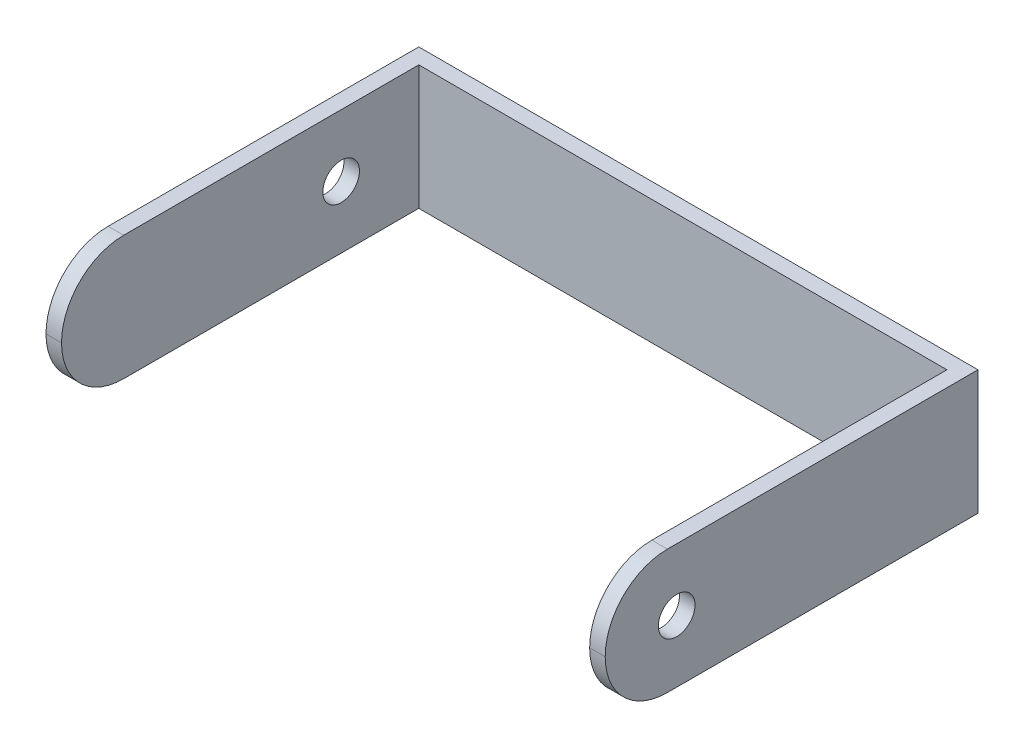
ISO-10303-21;
HEADER;
FILE_DESCRIPTION(('STEP AP214'),'2;1');
FILE_NAME('part.step','',(''),(''),'','','');
FILE_SCHEMA(('AUTOMOTIVE_DESIGN { 1 0 10303 214 1 1 1 1 }'));
ENDSEC;
DATA;
#1=APPLICATION_CONTEXT('core data for automotive mechanical design processes');
#2=APPLICATION_PROTOCOL_DEFINITION('international standard','automotive_design',2000,#1);
#3=PRODUCT_CONTEXT('',#1,'mechanical');
#4=PRODUCT('Part','Part','',(#3));
#5=PRODUCT_RELATED_PRODUCT_CATEGORY('part','',(#4));
#6=PRODUCT_DEFINITION_FORMATION('','',#4);
#7=PRODUCT_DEFINITION_CONTEXT('part definition',#1,'design');
#8=PRODUCT_DEFINITION('design','',#6,#7);
#9=PRODUCT_DEFINITION_SHAPE('','',#8);
#10=(LENGTH_UNIT() NAMED_UNIT(*) SI_UNIT(.MILLI.,.METRE.));
#11=(NAMED_UNIT(*) PLANE_ANGLE_UNIT() SI_UNIT($,.RADIAN.));
#12=(NAMED_UNIT(*) SI_UNIT($,.STERADIAN.) SOLID_ANGLE_UNIT());
#13=UNCERTAINTY_MEASURE_WITH_UNIT(LENGTH_MEASURE(1.E-05),#10,'distance_accuracy_value','');
#14=(GEOMETRIC_REPRESENTATION_CONTEXT(3) GLOBAL_UNCERTAINTY_ASSIGNED_CONTEXT((#13)) GLOBAL_UNIT_ASSIGNED_CONTEXT((#10,
#11,#12)) REPRESENTATION_CONTEXT('',''));
#15=CARTESIAN_POINT('',(0.,0.,0.));
#16=DIRECTION('',(0.,0.,1.));
#17=DIRECTION('',(1.,0.,0.));
#18=AXIS2_PLACEMENT_3D('',#15,#16,#17);
#19=CARTESIAN_POINT('',(0.,0.,12.7));
#20=DIRECTION('',(0.,0.,1.));
#21=DIRECTION('',(1.,0.,0.));
#22=AXIS2_PLACEMENT_3D('',#19,#20,#21);
#23=PLANE('',#22);
#24=DIRECTION('',(0.,-1.,0.));
#25=VECTOR('',#24,1.);
#26=CARTESIAN_POINT('',(444.5,101.6,12.7));
#27=LINE('',#26,#25);
#28=CARTESIAN_POINT('',(444.5,101.6,12.7));
#29=VERTEX_POINT('',#28);
#30=CARTESIAN_POINT('',(444.5,0.,12.7));
#31=VERTEX_POINT('',#30);
#32=EDGE_CURVE('E118',#29,#31,#27,.T.);
#33=ORIENTED_EDGE('',*,*,#32,.F.);
#34=DIRECTION('',(-1.,0.,0.));
#35=VECTOR('',#34,1.);
#36=CARTESIAN_POINT('',(457.2,101.6,12.7));
#37=LINE('',#36,#35);
#38=CARTESIAN_POINT('',(12.7,101.6,12.7));
#39=VERTEX_POINT('',#38);
#40=EDGE_CURVE('E126',#29,#39,#37,.T.);
#41=ORIENTED_EDGE('',*,*,#40,.T.);
#42=DIRECTION('',(0.,-1.,0.));
#43=VECTOR('',#42,1.);
#44=CARTESIAN_POINT('',(12.7,101.6,12.7));
#45=LINE('',#44,#43);
#46=CARTESIAN_POINT('',(12.7,0.,12.7));
#47=VERTEX_POINT('',#46);
#48=EDGE_CURVE('E143',#39,#47,#45,.T.);
#49=ORIENTED_EDGE('',*,*,#48,.T.);
#50=DIRECTION('',(1.,0.,0.));
#51=VECTOR('',#50,1.);
#52=CARTESIAN_POINT('',(0.,0.,12.7));
#53=LINE('',#52,#51);
#54=EDGE_CURVE('E134',#47,#31,#53,.T.);
#55=ORIENTED_EDGE('',*,*,#54,.T.);
#56=EDGE_LOOP('',(#33,#41,#49,#55));
#57=FACE_BOUND('',#56,.T.);
#58=ADVANCED_FACE('F39',(#57),#23,.T.);
#59=CARTESIAN_POINT('',(0.,101.6,12.7));
#60=DIRECTION('',(1.,0.,0.));
#61=DIRECTION('',(0.,1.,0.));
#62=AXIS2_PLACEMENT_3D('',#59,#60,#61);
#63=PLANE('',#62);
#64=CARTESIAN_POINT('',(0.,50.8,76.2));
#65=DIRECTION('',(-1.,0.,0.));
#66=DIRECTION('',(0.,-1.,0.));
#67=AXIS2_PLACEMENT_3D('',#64,#65,#66);
#68=CIRCLE('',#67,14.985);
#69=CARTESIAN_POINT('',(0.,35.815,76.2));
#70=VERTEX_POINT('',#69);
#71=EDGE_CURVE('E382',#70,#70,#68,.T.);
#72=ORIENTED_EDGE('',*,*,#71,.F.);
#73=EDGE_LOOP('',(#72));
#74=FACE_BOUND('',#73,.T.);
#75=DIRECTION('',(0.,0.,-1.));
#76=VECTOR('',#75,1.);
#77=CARTESIAN_POINT('',(0.,0.,12.7));
#78=LINE('',#77,#76);
#79=CARTESIAN_POINT('',(0.,0.,254.));
#80=VERTEX_POINT('',#79);
#81=CARTESIAN_POINT('',(0.,0.,0.));
#82=VERTEX_POINT('',#81);
#83=EDGE_CURVE('E164',#80,#82,#78,.T.);
#84=ORIENTED_EDGE('',*,*,#83,.F.);
#85=CARTESIAN_POINT('',(0.,50.8,254.));
#86=DIRECTION('',(1.,0.,0.));
#87=DIRECTION('',(0.,1.,0.));
#88=AXIS2_PLACEMENT_3D('',#85,#86,#87);
#89=CIRCLE('',#88,50.8);
#90=CARTESIAN_POINT('',(0.,50.8,304.8));
#91=VERTEX_POINT('',#90);
#92=EDGE_CURVE('E48',#80,#91,#89,.F.);
#93=ORIENTED_EDGE('',*,*,#92,.T.);
#94=CARTESIAN_POINT('',(0.,50.8,254.));
#95=DIRECTION('',(1.,0.,0.));
#96=DIRECTION('',(0.,1.,0.));
#97=AXIS2_PLACEMENT_3D('',#94,#95,#96);
#98=CIRCLE('',#97,50.8);
#99=CARTESIAN_POINT('',(0.,101.6,254.));
#100=VERTEX_POINT('',#99);
#101=EDGE_CURVE('E55',#91,#100,#98,.F.);
#102=ORIENTED_EDGE('',*,*,#101,.T.);
#103=DIRECTION('',(0.,0.,-1.));
#104=VECTOR('',#103,1.);
#105=CARTESIAN_POINT('',(0.,101.6,12.7));
#106=LINE('',#105,#104);
#107=CARTESIAN_POINT('',(0.,101.6,0.));
#108=VERTEX_POINT('',#107);
#109=EDGE_CURVE('E133',#100,#108,#106,.T.);
#110=ORIENTED_EDGE('',*,*,#109,.T.);
#111=DIRECTION('',(0.,-1.,0.));
#112=VECTOR('',#111,1.);
#113=CARTESIAN_POINT('',(0.,101.6,0.));
#114=LINE('',#113,#112);
#115=EDGE_CURVE('E146',#108,#82,#114,.T.);
#116=ORIENTED_EDGE('',*,*,#115,.T.);
#117=EDGE_LOOP('',(#84,#93,#102,#110,#116));
#118=FACE_BOUND('',#117,.T.);
#119=ADVANCED_FACE('F197',(#74,#118),#63,.F.);
#120=CARTESIAN_POINT('',(0.,0.,12.7));
#121=DIRECTION('',(0.,1.,0.));
#122=DIRECTION('',(0.,0.,1.));
#123=AXIS2_PLACEMENT_3D('',#120,#121,#122);
#124=PLANE('',#123);
#125=DIRECTION('',(0.,0.,-1.));
#126=VECTOR('',#125,1.);
#127=CARTESIAN_POINT('',(12.7,0.,0.));
#128=LINE('',#127,#126);
#129=CARTESIAN_POINT('',(12.7,0.,254.));
#130=VERTEX_POINT('',#129);
#131=EDGE_CURVE('E138',#130,#47,#128,.T.);
#132=ORIENTED_EDGE('',*,*,#131,.F.);
#133=DIRECTION('',(1.,0.,0.));
#134=VECTOR('',#133,1.);
#135=CARTESIAN_POINT('',(0.,0.,254.));
#136=LINE('',#135,#134);
#137=EDGE_CURVE('E186',#130,#80,#136,.F.);
#138=ORIENTED_EDGE('',*,*,#137,.T.);
#139=ORIENTED_EDGE('',*,*,#83,.T.);
#140=DIRECTION('',(1.,0.,0.));
#141=VECTOR('',#140,1.);
#142=CARTESIAN_POINT('',(0.,0.,0.));
#143=LINE('',#142,#141);
#144=CARTESIAN_POINT('',(457.2,0.,0.));
#145=VERTEX_POINT('',#144);
#146=EDGE_CURVE('E151',#82,#145,#143,.T.);
#147=ORIENTED_EDGE('',*,*,#146,.T.);
#148=DIRECTION('',(0.,0.,-1.));
#149=VECTOR('',#148,1.);
#150=CARTESIAN_POINT('',(457.2,0.,12.7));
#151=LINE('',#150,#149);
#152=CARTESIAN_POINT('',(457.2,0.,254.));
#153=VERTEX_POINT('',#152);
#154=EDGE_CURVE('E162',#153,#145,#151,.T.);
#155=ORIENTED_EDGE('',*,*,#154,.F.);
#156=DIRECTION('',(-1.,0.,0.));
#157=VECTOR('',#156,1.);
#158=CARTESIAN_POINT('',(444.5,0.,254.));
#159=LINE('',#158,#157);
#160=CARTESIAN_POINT('',(444.5,0.,254.));
#161=VERTEX_POINT('',#160);
#162=EDGE_CURVE('E166',#153,#161,#159,.T.);
#163=ORIENTED_EDGE('',*,*,#162,.T.);
#164=DIRECTION('',(0.,0.,-1.));
#165=VECTOR('',#164,1.);
#166=CARTESIAN_POINT('',(444.5,0.,304.8));
#167=LINE('',#166,#165);
#168=EDGE_CURVE('E123',#161,#31,#167,.T.);
#169=ORIENTED_EDGE('',*,*,#168,.T.);
#170=ORIENTED_EDGE('',*,*,#54,.F.);
#171=EDGE_LOOP('',(#132,#138,#139,#147,#155,#163,#169,#170));
#172=FACE_BOUND('',#171,.T.);
#173=ADVANCED_FACE('F193',(#172),#124,.F.);
#174=CARTESIAN_POINT('',(457.2,0.,12.7));
#175=DIRECTION('',(-1.,0.,0.));
#176=DIRECTION('',(0.,0.,1.));
#177=AXIS2_PLACEMENT_3D('',#174,#175,#176);
#178=PLANE('',#177);
#179=CARTESIAN_POINT('',(457.2,50.8,246.361498901065));
#180=DIRECTION('',(1.,0.,0.));
#181=DIRECTION('',(0.,0.,-1.));
#182=AXIS2_PLACEMENT_3D('',#179,#180,#181);
#183=CIRCLE('',#182,14.985);
#184=CARTESIAN_POINT('',(457.2,50.8,231.376498901065));
#185=VERTEX_POINT('',#184);
#186=EDGE_CURVE('E182',#185,#185,#183,.T.);
#187=ORIENTED_EDGE('',*,*,#186,.F.);
#188=EDGE_LOOP('',(#187));
#189=FACE_BOUND('',#188,.T.);
#190=CARTESIAN_POINT('',(457.2,50.8000000000001,254.));
#191=DIRECTION('',(-1.,0.,0.));
#192=DIRECTION('',(0.,0.,1.));
#193=AXIS2_PLACEMENT_3D('',#190,#191,#192);
#194=CIRCLE('',#193,50.8);
#195=CARTESIAN_POINT('',(457.2,101.6,254.));
#196=VERTEX_POINT('',#195);
#197=CARTESIAN_POINT('',(457.2,50.8000000000001,304.8));
#198=VERTEX_POINT('',#197);
#199=EDGE_CURVE('E172',#196,#198,#194,.F.);
#200=ORIENTED_EDGE('',*,*,#199,.T.);
#201=CARTESIAN_POINT('',(457.2,50.8,254.));
#202=DIRECTION('',(-1.,0.,0.));
#203=DIRECTION('',(0.,0.,1.));
#204=AXIS2_PLACEMENT_3D('',#201,#202,#203);
#205=CIRCLE('',#204,50.8);
#206=EDGE_CURVE('E174',#198,#153,#205,.F.);
#207=ORIENTED_EDGE('',*,*,#206,.T.);
#208=ORIENTED_EDGE('',*,*,#154,.T.);
#209=DIRECTION('',(0.,1.,0.));
#210=VECTOR('',#209,1.);
#211=CARTESIAN_POINT('',(457.2,0.,0.));
#212=LINE('',#211,#210);
#213=CARTESIAN_POINT('',(457.2,101.6,0.));
#214=VERTEX_POINT('',#213);
#215=EDGE_CURVE('E154',#145,#214,#212,.T.);
#216=ORIENTED_EDGE('',*,*,#215,.T.);
#217=DIRECTION('',(0.,0.,-1.));
#218=VECTOR('',#217,1.);
#219=CARTESIAN_POINT('',(457.2,101.6,12.7));
#220=LINE('',#219,#218);
#221=EDGE_CURVE('E160',#196,#214,#220,.T.);
#222=ORIENTED_EDGE('',*,*,#221,.F.);
#223=EDGE_LOOP('',(#200,#207,#208,#216,#222));
#224=FACE_BOUND('',#223,.T.);
#225=ADVANCED_FACE('F214',(#189,#224),#178,.F.);
#226=CARTESIAN_POINT('',(457.2,101.6,12.7));
#227=DIRECTION('',(0.,-1.,0.));
#228=DIRECTION('',(1.,0.,0.));
#229=AXIS2_PLACEMENT_3D('',#226,#227,#228);
#230=PLANE('',#229);
#231=ORIENTED_EDGE('',*,*,#109,.F.);
#232=DIRECTION('',(1.,0.,0.));
#233=VECTOR('',#232,1.);
#234=CARTESIAN_POINT('',(457.2,101.6,254.));
#235=LINE('',#234,#233);
#236=CARTESIAN_POINT('',(12.7,101.6,254.));
#237=VERTEX_POINT('',#236);
#238=EDGE_CURVE('E11',#100,#237,#235,.T.);
#239=ORIENTED_EDGE('',*,*,#238,.T.);
#240=DIRECTION('',(0.,0.,-1.));
#241=VECTOR('',#240,1.);
#242=CARTESIAN_POINT('',(12.7,101.6,0.));
#243=LINE('',#242,#241);
#244=EDGE_CURVE('E129',#237,#39,#243,.T.);
#245=ORIENTED_EDGE('',*,*,#244,.T.);
#246=ORIENTED_EDGE('',*,*,#40,.F.);
#247=DIRECTION('',(0.,0.,-1.));
#248=VECTOR('',#247,1.);
#249=CARTESIAN_POINT('',(444.5,101.6,304.8));
#250=LINE('',#249,#248);
#251=CARTESIAN_POINT('',(444.5,101.6,254.));
#252=VERTEX_POINT('',#251);
#253=EDGE_CURVE('E113',#252,#29,#250,.T.);
#254=ORIENTED_EDGE('',*,*,#253,.F.);
#255=DIRECTION('',(-1.,0.,0.));
#256=VECTOR('',#255,1.);
#257=CARTESIAN_POINT('',(457.2,101.6,254.));
#258=LINE('',#257,#256);
#259=EDGE_CURVE('E176',#252,#196,#258,.F.);
#260=ORIENTED_EDGE('',*,*,#259,.T.);
#261=ORIENTED_EDGE('',*,*,#221,.T.);
#262=DIRECTION('',(-1.,0.,0.));
#263=VECTOR('',#262,1.);
#264=CARTESIAN_POINT('',(457.2,101.6,0.));
#265=LINE('',#264,#263);
#266=EDGE_CURVE('E147',#214,#108,#265,.T.);
#267=ORIENTED_EDGE('',*,*,#266,.T.);
#268=EDGE_LOOP('',(#231,#239,#245,#246,#254,#260,#261,#267));
#269=FACE_BOUND('',#268,.T.);
#270=ADVANCED_FACE('F127',(#269),#230,.F.);
#271=CARTESIAN_POINT('',(0.,0.,0.));
#272=DIRECTION('',(0.,0.,1.));
#273=DIRECTION('',(1.,0.,0.));
#274=AXIS2_PLACEMENT_3D('',#271,#272,#273);
#275=PLANE('',#274);
#276=ORIENTED_EDGE('',*,*,#115,.F.);
#277=ORIENTED_EDGE('',*,*,#266,.F.);
#278=ORIENTED_EDGE('',*,*,#215,.F.);
#279=ORIENTED_EDGE('',*,*,#146,.F.);
#280=EDGE_LOOP('',(#276,#277,#278,#279));
#281=FACE_BOUND('',#280,.T.);
#282=ADVANCED_FACE('F201',(#281),#275,.F.);
#283=CARTESIAN_POINT('',(12.7,101.6,0.));
#284=DIRECTION('',(-1.,0.,0.));
#285=DIRECTION('',(0.,0.,1.));
#286=AXIS2_PLACEMENT_3D('',#283,#284,#285);
#287=PLANE('',#286);
#288=CARTESIAN_POINT('',(12.7,50.8,76.2));
#289=DIRECTION('',(-1.,0.,0.));
#290=DIRECTION('',(0.,0.,1.));
#291=AXIS2_PLACEMENT_3D('',#288,#289,#290);
#292=CIRCLE('',#291,14.985);
#293=CARTESIAN_POINT('',(12.7,50.8,91.185));
#294=VERTEX_POINT('',#293);
#295=EDGE_CURVE('E249',#294,#294,#292,.F.);
#296=ORIENTED_EDGE('',*,*,#295,.F.);
#297=EDGE_LOOP('',(#296));
#298=FACE_BOUND('',#297,.T.);
#299=CARTESIAN_POINT('',(12.7,50.8,254.));
#300=DIRECTION('',(-1.,0.,0.));
#301=DIRECTION('',(0.,0.,1.));
#302=AXIS2_PLACEMENT_3D('',#299,#300,#301);
#303=CIRCLE('',#302,50.8);
#304=CARTESIAN_POINT('',(12.7,50.8,304.8));
#305=VERTEX_POINT('',#304);
#306=EDGE_CURVE('E178',#237,#305,#303,.F.);
#307=ORIENTED_EDGE('',*,*,#306,.T.);
#308=CARTESIAN_POINT('',(12.7,50.8,254.));
#309=DIRECTION('',(-1.,0.,0.));
#310=DIRECTION('',(0.,0.,1.));
#311=AXIS2_PLACEMENT_3D('',#308,#309,#310);
#312=CIRCLE('',#311,50.8);
#313=EDGE_CURVE('E184',#305,#130,#312,.F.);
#314=ORIENTED_EDGE('',*,*,#313,.T.);
#315=ORIENTED_EDGE('',*,*,#131,.T.);
#316=ORIENTED_EDGE('',*,*,#48,.F.);
#317=ORIENTED_EDGE('',*,*,#244,.F.);
#318=EDGE_LOOP('',(#307,#314,#315,#316,#317));
#319=FACE_BOUND('',#318,.T.);
#320=ADVANCED_FACE('F234',(#298,#319),#287,.F.);
#321=CARTESIAN_POINT('',(444.5,101.6,304.8));
#322=DIRECTION('',(-1.,0.,0.));
#323=DIRECTION('',(0.,0.,1.));
#324=AXIS2_PLACEMENT_3D('',#321,#322,#323);
#325=PLANE('',#324);
#326=CARTESIAN_POINT('',(444.5,50.8,246.361498901065));
#327=DIRECTION('',(-1.,0.,0.));
#328=DIRECTION('',(0.,0.,1.));
#329=AXIS2_PLACEMENT_3D('',#326,#327,#328);
#330=CIRCLE('',#329,14.985);
#331=CARTESIAN_POINT('',(444.5,50.8,261.346498901065));
#332=VERTEX_POINT('',#331);
#333=EDGE_CURVE('E376',#332,#332,#330,.F.);
#334=ORIENTED_EDGE('',*,*,#333,.T.);
#335=EDGE_LOOP('',(#334));
#336=FACE_BOUND('',#335,.T.);
#337=ORIENTED_EDGE('',*,*,#168,.F.);
#338=CARTESIAN_POINT('',(444.5,50.8,254.));
#339=DIRECTION('',(-1.,0.,0.));
#340=DIRECTION('',(0.,0.,1.));
#341=AXIS2_PLACEMENT_3D('',#338,#339,#340);
#342=CIRCLE('',#341,50.8);
#343=CARTESIAN_POINT('',(444.5,50.8000000000001,304.8));
#344=VERTEX_POINT('',#343);
#345=EDGE_CURVE('E170',#161,#344,#342,.T.);
#346=ORIENTED_EDGE('',*,*,#345,.T.);
#347=CARTESIAN_POINT('',(444.5,50.8000000000001,254.));
#348=DIRECTION('',(-1.,0.,0.));
#349=DIRECTION('',(0.,0.,1.));
#350=AXIS2_PLACEMENT_3D('',#347,#348,#349);
#351=CIRCLE('',#350,50.8);
#352=EDGE_CURVE('E120',#344,#252,#351,.T.);
#353=ORIENTED_EDGE('',*,*,#352,.T.);
#354=ORIENTED_EDGE('',*,*,#253,.T.);
#355=ORIENTED_EDGE('',*,*,#32,.T.);
#356=EDGE_LOOP('',(#337,#346,#353,#354,#355));
#357=FACE_BOUND('',#356,.T.);
#358=ADVANCED_FACE('F116',(#336,#357),#325,.T.);
#359=CARTESIAN_POINT('',(-0.000999999999973245,50.8,246.361498901065));
#360=DIRECTION('',(1.,0.,0.));
#361=DIRECTION('',(0.,0.,-1.));
#362=AXIS2_PLACEMENT_3D('',#359,#360,#361);
#363=CYLINDRICAL_SURFACE('',#362,14.985);
#364=ORIENTED_EDGE('',*,*,#333,.F.);
#365=EDGE_LOOP('',(#364));
#366=FACE_BOUND('',#365,.T.);
#367=ORIENTED_EDGE('',*,*,#186,.T.);
#368=EDGE_LOOP('',(#367));
#369=FACE_BOUND('',#368,.T.);
#370=ADVANCED_FACE('F244',(#366,#369),#363,.F.);
#371=CARTESIAN_POINT('',(457.2,50.8000000000001,254.));
#372=DIRECTION('',(1.,0.,0.));
#373=DIRECTION('',(0.,1.,0.));
#374=AXIS2_PLACEMENT_3D('',#371,#372,#373);
#375=CYLINDRICAL_SURFACE('',#374,50.8);
#376=DIRECTION('',(-1.,0.,0.));
#377=VECTOR('',#376,1.);
#378=CARTESIAN_POINT('',(444.5,50.8000000000001,304.8));
#379=LINE('',#378,#377);
#380=EDGE_CURVE('E179',#198,#344,#379,.T.);
#381=ORIENTED_EDGE('',*,*,#380,.F.);
#382=ORIENTED_EDGE('',*,*,#199,.F.);
#383=ORIENTED_EDGE('',*,*,#259,.F.);
#384=ORIENTED_EDGE('',*,*,#352,.F.);
#385=EDGE_LOOP('',(#381,#382,#383,#384));
#386=FACE_BOUND('',#385,.T.);
#387=ADVANCED_FACE('F211',(#386),#375,.T.);
#388=CARTESIAN_POINT('',(0.,50.8,254.));
#389=DIRECTION('',(1.,0.,0.));
#390=DIRECTION('',(0.,0.,-1.));
#391=AXIS2_PLACEMENT_3D('',#388,#389,#390);
#392=CYLINDRICAL_SURFACE('',#391,50.8);
#393=ORIENTED_EDGE('',*,*,#206,.F.);
#394=ORIENTED_EDGE('',*,*,#380,.T.);
#395=ORIENTED_EDGE('',*,*,#345,.F.);
#396=ORIENTED_EDGE('',*,*,#162,.F.);
#397=EDGE_LOOP('',(#393,#394,#395,#396));
#398=FACE_BOUND('',#397,.T.);
#399=ADVANCED_FACE('F208',(#398),#392,.T.);
#400=CARTESIAN_POINT('',(457.2,50.8000000000001,254.));
#401=DIRECTION('',(1.,0.,0.));
#402=DIRECTION('',(0.,1.,0.));
#403=AXIS2_PLACEMENT_3D('',#400,#401,#402);
#404=CYLINDRICAL_SURFACE('',#403,50.8);
#405=ORIENTED_EDGE('',*,*,#238,.F.);
#406=ORIENTED_EDGE('',*,*,#101,.F.);
#407=DIRECTION('',(1.,0.,0.));
#408=VECTOR('',#407,1.);
#409=CARTESIAN_POINT('',(0.,50.8,304.8));
#410=LINE('',#409,#408);
#411=EDGE_CURVE('E43',#305,#91,#410,.F.);
#412=ORIENTED_EDGE('',*,*,#411,.F.);
#413=ORIENTED_EDGE('',*,*,#306,.F.);
#414=EDGE_LOOP('',(#405,#406,#412,#413));
#415=FACE_BOUND('',#414,.T.);
#416=ADVANCED_FACE('F41',(#415),#404,.T.);
#417=CARTESIAN_POINT('',(0.,50.8,254.));
#418=DIRECTION('',(1.,0.,0.));
#419=DIRECTION('',(0.,0.,-1.));
#420=AXIS2_PLACEMENT_3D('',#417,#418,#419);
#421=CYLINDRICAL_SURFACE('',#420,50.8);
#422=ORIENTED_EDGE('',*,*,#92,.F.);
#423=ORIENTED_EDGE('',*,*,#137,.F.);
#424=ORIENTED_EDGE('',*,*,#313,.F.);
#425=ORIENTED_EDGE('',*,*,#411,.T.);
#426=EDGE_LOOP('',(#422,#423,#424,#425));
#427=FACE_BOUND('',#426,.T.);
#428=ADVANCED_FACE('F255',(#427),#421,.T.);
#429=CARTESIAN_POINT('',(457.201,50.8,76.2));
#430=DIRECTION('',(-1.,0.,0.));
#431=DIRECTION('',(0.,-1.,0.));
#432=AXIS2_PLACEMENT_3D('',#429,#430,#431);
#433=CYLINDRICAL_SURFACE('',#432,14.985);
#434=ORIENTED_EDGE('',*,*,#71,.T.);
#435=EDGE_LOOP('',(#434));
#436=FACE_BOUND('',#435,.T.);
#437=ORIENTED_EDGE('',*,*,#295,.T.);
#438=EDGE_LOOP('',(#437));
#439=FACE_BOUND('',#438,.T.);
#440=ADVANCED_FACE('F257',(#436,#439),#433,.F.);
#441=CLOSED_SHELL('',(#58,#119,#173,#225,#270,#282,#320,#358,#370,#387,#399,#416,#428,#440));
#442=MANIFOLD_SOLID_BREP('B2',#441);
#443=ADVANCED_BREP_SHAPE_REPRESENTATION('',(#18,#442),#14);
#444=SHAPE_DEFINITION_REPRESENTATION(#9,#443);
ENDSEC;
END-ISO-10303-21;
